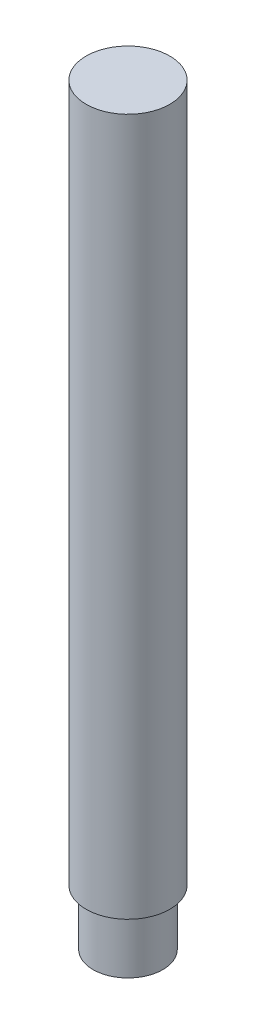
ISO-10303-21;
HEADER;
FILE_DESCRIPTION(('STEP AP214'),'2;1');
FILE_NAME('part.step','',(''),(''),'','','');
FILE_SCHEMA(('AUTOMOTIVE_DESIGN { 1 0 10303 214 1 1 1 1 }'));
ENDSEC;
DATA;
#1=APPLICATION_CONTEXT('core data for automotive mechanical design processes');
#2=APPLICATION_PROTOCOL_DEFINITION('international standard','automotive_design',2000,#1);
#3=PRODUCT_CONTEXT('',#1,'mechanical');
#4=PRODUCT('Part','Part','',(#3));
#5=PRODUCT_RELATED_PRODUCT_CATEGORY('part','',(#4));
#6=PRODUCT_DEFINITION_FORMATION('','',#4);
#7=PRODUCT_DEFINITION_CONTEXT('part definition',#1,'design');
#8=PRODUCT_DEFINITION('design','',#6,#7);
#9=PRODUCT_DEFINITION_SHAPE('','',#8);
#10=(LENGTH_UNIT() NAMED_UNIT(*) SI_UNIT(.MILLI.,.METRE.));
#11=(NAMED_UNIT(*) PLANE_ANGLE_UNIT() SI_UNIT($,.RADIAN.));
#12=(NAMED_UNIT(*) SI_UNIT($,.STERADIAN.) SOLID_ANGLE_UNIT());
#13=UNCERTAINTY_MEASURE_WITH_UNIT(LENGTH_MEASURE(1.E-05),#10,'distance_accuracy_value','');
#14=(GEOMETRIC_REPRESENTATION_CONTEXT(3) GLOBAL_UNCERTAINTY_ASSIGNED_CONTEXT((#13)) GLOBAL_UNIT_ASSIGNED_CONTEXT((#10,
#11,#12)) REPRESENTATION_CONTEXT('',''));
#15=CARTESIAN_POINT('',(0.,0.,0.));
#16=DIRECTION('',(0.,0.,1.));
#17=DIRECTION('',(1.,0.,0.));
#18=AXIS2_PLACEMENT_3D('',#15,#16,#17);
#19=CARTESIAN_POINT('',(0.,54.,0.));
#20=DIRECTION('',(0.,-1.,0.));
#21=DIRECTION('',(0.,0.,-1.));
#22=AXIS2_PLACEMENT_3D('',#19,#20,#21);
#23=PLANE('',#22);
#24=CARTESIAN_POINT('',(0.,54.,0.));
#25=DIRECTION('',(0.,1.,0.));
#26=DIRECTION('',(0.,0.,1.));
#27=AXIS2_PLACEMENT_3D('',#24,#25,#26);
#28=CIRCLE('',#27,2.99999999999999);
#29=CARTESIAN_POINT('',(0.,54.,2.99999999999999));
#30=VERTEX_POINT('',#29);
#31=EDGE_CURVE('E10',#30,#30,#28,.T.);
#32=ORIENTED_EDGE('',*,*,#31,.T.);
#33=EDGE_LOOP('',(#32));
#34=FACE_BOUND('',#33,.T.);
#35=ADVANCED_FACE('F32',(#34),#23,.F.);
#36=CARTESIAN_POINT('',(0.,48.8953984846202,0.));
#37=DIRECTION('',(0.,1.,0.));
#38=DIRECTION('',(0.,0.,1.));
#39=AXIS2_PLACEMENT_3D('',#36,#37,#38);
#40=CYLINDRICAL_SURFACE('',#39,3.);
#41=ORIENTED_EDGE('',*,*,#31,.F.);
#42=EDGE_LOOP('',(#41));
#43=FACE_BOUND('',#42,.T.);
#44=CARTESIAN_POINT('',(0.,4.,0.));
#45=DIRECTION('',(0.,1.,0.));
#46=DIRECTION('',(0.,0.,1.));
#47=AXIS2_PLACEMENT_3D('',#44,#45,#46);
#48=CIRCLE('',#47,3.00000000000001);
#49=CARTESIAN_POINT('',(0.,4.,3.00000000000001));
#50=VERTEX_POINT('',#49);
#51=EDGE_CURVE('E38',#50,#50,#48,.T.);
#52=ORIENTED_EDGE('',*,*,#51,.T.);
#53=EDGE_LOOP('',(#52));
#54=FACE_BOUND('',#53,.T.);
#55=ADVANCED_FACE('F64',(#43,#54),#40,.T.);
#56=CARTESIAN_POINT('',(3.00000000000001,4.,0.));
#57=DIRECTION('',(0.,1.,0.));
#58=DIRECTION('',(0.,0.,1.));
#59=AXIS2_PLACEMENT_3D('',#56,#57,#58);
#60=PLANE('',#59);
#61=ORIENTED_EDGE('',*,*,#51,.F.);
#62=EDGE_LOOP('',(#61));
#63=FACE_BOUND('',#62,.T.);
#64=CARTESIAN_POINT('',(0.,4.,0.));
#65=DIRECTION('',(0.,1.,0.));
#66=DIRECTION('',(0.,0.,1.));
#67=AXIS2_PLACEMENT_3D('',#64,#65,#66);
#68=CIRCLE('',#67,2.50000000000001);
#69=CARTESIAN_POINT('',(0.,4.,2.50000000000001));
#70=VERTEX_POINT('',#69);
#71=EDGE_CURVE('E42',#70,#70,#68,.T.);
#72=ORIENTED_EDGE('',*,*,#71,.T.);
#73=EDGE_LOOP('',(#72));
#74=FACE_BOUND('',#73,.T.);
#75=ADVANCED_FACE('F60',(#63,#74),#60,.F.);
#76=CARTESIAN_POINT('',(0.,48.8953984846202,0.));
#77=DIRECTION('',(0.,1.,0.));
#78=DIRECTION('',(0.,0.,1.));
#79=AXIS2_PLACEMENT_3D('',#76,#77,#78);
#80=CYLINDRICAL_SURFACE('',#79,2.50000000000001);
#81=ORIENTED_EDGE('',*,*,#71,.F.);
#82=EDGE_LOOP('',(#81));
#83=FACE_BOUND('',#82,.T.);
#84=CARTESIAN_POINT('',(0.,0.,0.));
#85=DIRECTION('',(0.,1.,0.));
#86=DIRECTION('',(0.,0.,1.));
#87=AXIS2_PLACEMENT_3D('',#84,#85,#86);
#88=CIRCLE('',#87,2.50000000000001);
#89=CARTESIAN_POINT('',(0.,0.,2.50000000000001));
#90=VERTEX_POINT('',#89);
#91=EDGE_CURVE('E46',#90,#90,#88,.T.);
#92=ORIENTED_EDGE('',*,*,#91,.T.);
#93=EDGE_LOOP('',(#92));
#94=FACE_BOUND('',#93,.T.);
#95=ADVANCED_FACE('F52',(#83,#94),#80,.T.);
#96=CARTESIAN_POINT('',(2.50000000000001,0.,0.));
#97=DIRECTION('',(0.,1.,0.));
#98=DIRECTION('',(0.,0.,1.));
#99=AXIS2_PLACEMENT_3D('',#96,#97,#98);
#100=PLANE('',#99);
#101=ORIENTED_EDGE('',*,*,#91,.F.);
#102=EDGE_LOOP('',(#101));
#103=FACE_BOUND('',#102,.T.);
#104=ADVANCED_FACE('F54',(#103),#100,.F.);
#105=CLOSED_SHELL('',(#35,#55,#75,#95,#104));
#106=MANIFOLD_SOLID_BREP('B2',#105);
#107=ADVANCED_BREP_SHAPE_REPRESENTATION('',(#18,#106),#14);
#108=SHAPE_DEFINITION_REPRESENTATION(#9,#107);
ENDSEC;
END-ISO-10303-21;
